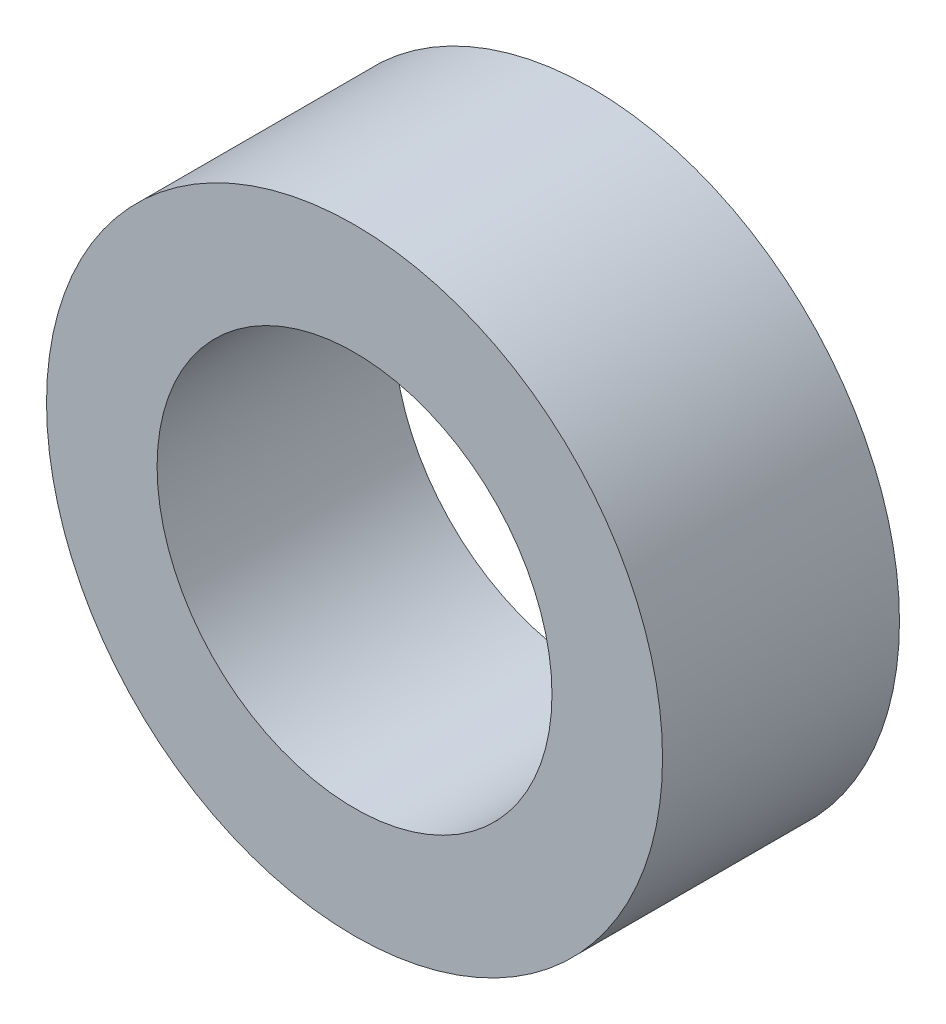
ISO-10303-21;
HEADER;
FILE_DESCRIPTION(('STEP AP214'),'2;1');
FILE_NAME('part.step','',(''),(''),'','','');
FILE_SCHEMA(('AUTOMOTIVE_DESIGN { 1 0 10303 214 1 1 1 1 }'));
ENDSEC;
DATA;
#1=APPLICATION_CONTEXT('core data for automotive mechanical design processes');
#2=APPLICATION_PROTOCOL_DEFINITION('international standard','automotive_design',2000,#1);
#3=PRODUCT_CONTEXT('',#1,'mechanical');
#4=PRODUCT('Part','Part','',(#3));
#5=PRODUCT_RELATED_PRODUCT_CATEGORY('part','',(#4));
#6=PRODUCT_DEFINITION_FORMATION('','',#4);
#7=PRODUCT_DEFINITION_CONTEXT('part definition',#1,'design');
#8=PRODUCT_DEFINITION('design','',#6,#7);
#9=PRODUCT_DEFINITION_SHAPE('','',#8);
#10=(LENGTH_UNIT() NAMED_UNIT(*) SI_UNIT(.MILLI.,.METRE.));
#11=(NAMED_UNIT(*) PLANE_ANGLE_UNIT() SI_UNIT($,.RADIAN.));
#12=(NAMED_UNIT(*) SI_UNIT($,.STERADIAN.) SOLID_ANGLE_UNIT());
#13=UNCERTAINTY_MEASURE_WITH_UNIT(LENGTH_MEASURE(1.E-05),#10,'distance_accuracy_value','');
#14=(GEOMETRIC_REPRESENTATION_CONTEXT(3) GLOBAL_UNCERTAINTY_ASSIGNED_CONTEXT((#13)) GLOBAL_UNIT_ASSIGNED_CONTEXT((#10,
#11,#12)) REPRESENTATION_CONTEXT('',''));
#15=CARTESIAN_POINT('',(0.,0.,0.));
#16=DIRECTION('',(0.,0.,1.));
#17=DIRECTION('',(1.,0.,0.));
#18=AXIS2_PLACEMENT_3D('',#15,#16,#17);
#19=CARTESIAN_POINT('',(0.,0.,6.));
#20=DIRECTION('',(0.,0.,1.));
#21=DIRECTION('',(1.,0.,0.));
#22=AXIS2_PLACEMENT_3D('',#19,#20,#21);
#23=PLANE('',#22);
#24=CARTESIAN_POINT('',(0.,0.,6.));
#25=DIRECTION('',(0.,0.,1.));
#26=DIRECTION('',(1.,0.,0.));
#27=AXIS2_PLACEMENT_3D('',#24,#25,#26);
#28=CIRCLE('',#27,7.8);
#29=CARTESIAN_POINT('',(7.8,0.,6.));
#30=VERTEX_POINT('',#29);
#31=EDGE_CURVE('E12',#30,#30,#28,.T.);
#32=ORIENTED_EDGE('',*,*,#31,.T.);
#33=EDGE_LOOP('',(#32));
#34=FACE_BOUND('',#33,.T.);
#35=CARTESIAN_POINT('',(0.,0.,6.));
#36=DIRECTION('',(0.,0.,1.));
#37=DIRECTION('',(1.,0.,0.));
#38=AXIS2_PLACEMENT_3D('',#35,#36,#37);
#39=CIRCLE('',#38,5.);
#40=CARTESIAN_POINT('',(5.,0.,6.));
#41=VERTEX_POINT('',#40);
#42=EDGE_CURVE('E52',#41,#41,#39,.T.);
#43=ORIENTED_EDGE('',*,*,#42,.F.);
#44=EDGE_LOOP('',(#43));
#45=FACE_BOUND('',#44,.T.);
#46=ADVANCED_FACE('F41',(#34,#45),#23,.T.);
#47=CARTESIAN_POINT('',(0.,0.,0.));
#48=DIRECTION('',(0.,0.,1.));
#49=DIRECTION('',(1.,0.,0.));
#50=AXIS2_PLACEMENT_3D('',#47,#48,#49);
#51=PLANE('',#50);
#52=CARTESIAN_POINT('',(0.,0.,0.));
#53=DIRECTION('',(0.,0.,1.));
#54=DIRECTION('',(1.,0.,0.));
#55=AXIS2_PLACEMENT_3D('',#52,#53,#54);
#56=CIRCLE('',#55,7.8);
#57=CARTESIAN_POINT('',(7.8,0.,0.));
#58=VERTEX_POINT('',#57);
#59=EDGE_CURVE('E45',#58,#58,#56,.T.);
#60=ORIENTED_EDGE('',*,*,#59,.F.);
#61=EDGE_LOOP('',(#60));
#62=FACE_BOUND('',#61,.T.);
#63=CARTESIAN_POINT('',(0.,0.,0.));
#64=DIRECTION('',(0.,0.,1.));
#65=DIRECTION('',(1.,0.,0.));
#66=AXIS2_PLACEMENT_3D('',#63,#64,#65);
#67=CIRCLE('',#66,5.);
#68=CARTESIAN_POINT('',(5.,0.,0.));
#69=VERTEX_POINT('',#68);
#70=EDGE_CURVE('E54',#69,#69,#67,.T.);
#71=ORIENTED_EDGE('',*,*,#70,.T.);
#72=EDGE_LOOP('',(#71));
#73=FACE_BOUND('',#72,.T.);
#74=ADVANCED_FACE('F64',(#62,#73),#51,.F.);
#75=CARTESIAN_POINT('',(0.,0.,6.));
#76=DIRECTION('',(0.,0.,-1.));
#77=DIRECTION('',(-1.,0.,0.));
#78=AXIS2_PLACEMENT_3D('',#75,#76,#77);
#79=CYLINDRICAL_SURFACE('',#78,7.8);
#80=ORIENTED_EDGE('',*,*,#31,.F.);
#81=EDGE_LOOP('',(#80));
#82=FACE_BOUND('',#81,.T.);
#83=ORIENTED_EDGE('',*,*,#59,.T.);
#84=EDGE_LOOP('',(#83));
#85=FACE_BOUND('',#84,.T.);
#86=ADVANCED_FACE('F43',(#82,#85),#79,.T.);
#87=CARTESIAN_POINT('',(0.,0.,6.));
#88=DIRECTION('',(0.,0.,-1.));
#89=DIRECTION('',(-1.,0.,0.));
#90=AXIS2_PLACEMENT_3D('',#87,#88,#89);
#91=CYLINDRICAL_SURFACE('',#90,5.);
#92=ORIENTED_EDGE('',*,*,#42,.T.);
#93=EDGE_LOOP('',(#92));
#94=FACE_BOUND('',#93,.T.);
#95=ORIENTED_EDGE('',*,*,#70,.F.);
#96=EDGE_LOOP('',(#95));
#97=FACE_BOUND('',#96,.T.);
#98=ADVANCED_FACE('F60',(#94,#97),#91,.F.);
#99=CLOSED_SHELL('',(#46,#74,#86,#98));
#100=MANIFOLD_SOLID_BREP('B2',#99);
#101=ADVANCED_BREP_SHAPE_REPRESENTATION('',(#18,#100),#14);
#102=SHAPE_DEFINITION_REPRESENTATION(#9,#101);
ENDSEC;
END-ISO-10303-21;
